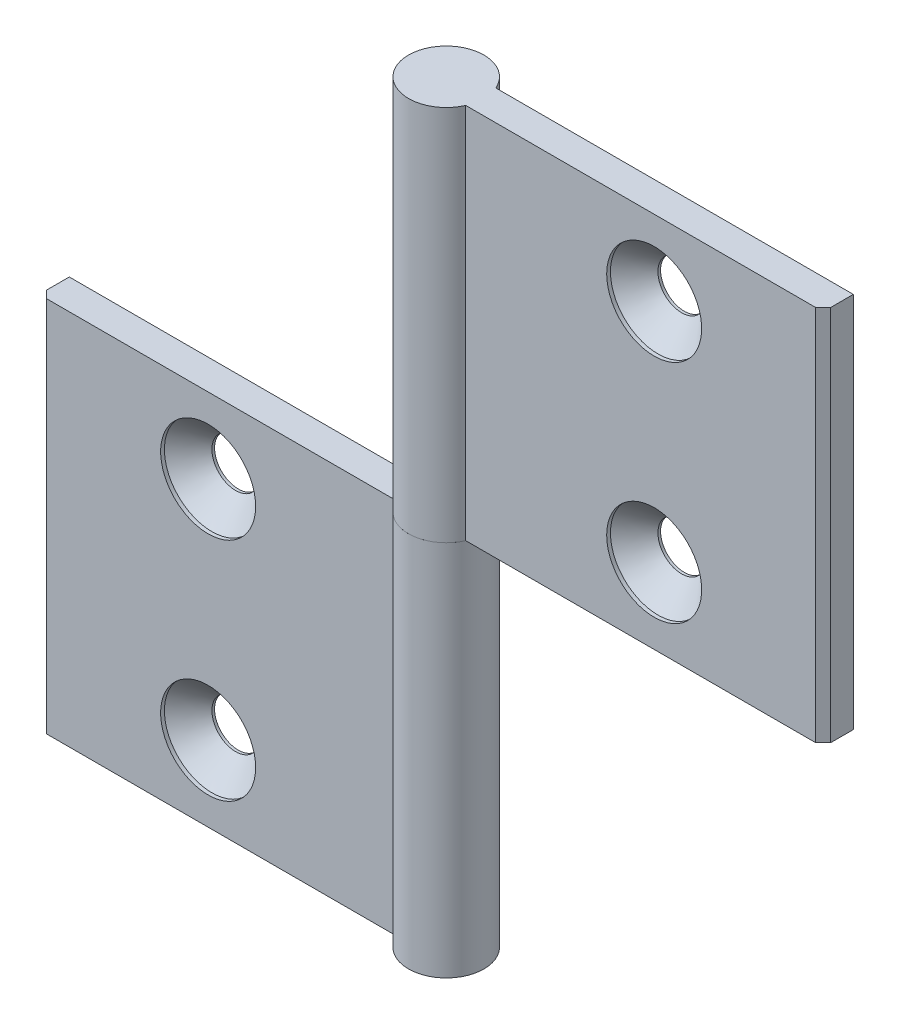
ISO-10303-21;
HEADER;
FILE_DESCRIPTION(('STEP AP214'),'2;1');
FILE_NAME('part.step','',(''),(''),'','','');
FILE_SCHEMA(('AUTOMOTIVE_DESIGN { 1 0 10303 214 1 1 1 1 }'));
ENDSEC;
DATA;
#1=APPLICATION_CONTEXT('core data for automotive mechanical design processes');
#2=APPLICATION_PROTOCOL_DEFINITION('international standard','automotive_design',2000,#1);
#3=PRODUCT_CONTEXT('',#1,'mechanical');
#4=PRODUCT('Part','Part','',(#3));
#5=PRODUCT_RELATED_PRODUCT_CATEGORY('part','',(#4));
#6=PRODUCT_DEFINITION_FORMATION('','',#4);
#7=PRODUCT_DEFINITION_CONTEXT('part definition',#1,'design');
#8=PRODUCT_DEFINITION('design','',#6,#7);
#9=PRODUCT_DEFINITION_SHAPE('','',#8);
#10=(LENGTH_UNIT() NAMED_UNIT(*) SI_UNIT(.MILLI.,.METRE.));
#11=(NAMED_UNIT(*) PLANE_ANGLE_UNIT() SI_UNIT($,.RADIAN.));
#12=(NAMED_UNIT(*) SI_UNIT($,.STERADIAN.) SOLID_ANGLE_UNIT());
#13=UNCERTAINTY_MEASURE_WITH_UNIT(LENGTH_MEASURE(1.E-05),#10,'distance_accuracy_value','');
#14=(GEOMETRIC_REPRESENTATION_CONTEXT(3) GLOBAL_UNCERTAINTY_ASSIGNED_CONTEXT((#13)) GLOBAL_UNIT_ASSIGNED_CONTEXT((#10,
#11,#12)) REPRESENTATION_CONTEXT('',''));
#15=CARTESIAN_POINT('',(0.,0.,0.));
#16=DIRECTION('',(0.,0.,1.));
#17=DIRECTION('',(1.,0.,0.));
#18=AXIS2_PLACEMENT_3D('',#15,#16,#17);
#19=CARTESIAN_POINT('',(0.,25.,0.));
#20=DIRECTION('',(0.,1.,0.));
#21=DIRECTION('',(0.,0.,-1.));
#22=AXIS2_PLACEMENT_3D('',#19,#20,#21);
#23=CYLINDRICAL_SURFACE('',#22,5.);
#24=CARTESIAN_POINT('',(0.,75.,0.));
#25=DIRECTION('',(0.,-1.,0.));
#26=DIRECTION('',(0.,0.,1.));
#27=AXIS2_PLACEMENT_3D('',#24,#25,#26);
#28=CIRCLE('',#27,5.);
#29=CARTESIAN_POINT('',(4.58257569495585,75.,1.99999999999997));
#30=VERTEX_POINT('',#29);
#31=CARTESIAN_POINT('',(4.58257569495582,75.,-2.00000000000004));
#32=VERTEX_POINT('',#31);
#33=EDGE_CURVE('E120',#30,#32,#28,.T.);
#34=ORIENTED_EDGE('',*,*,#33,.T.);
#35=DIRECTION('',(0.,1.,0.));
#36=VECTOR('',#35,1.);
#37=CARTESIAN_POINT('',(4.58257569495582,25.,-2.00000000000004));
#38=LINE('',#37,#36);
#39=CARTESIAN_POINT('',(4.58257569495582,25.,-2.00000000000004));
#40=VERTEX_POINT('',#39);
#41=EDGE_CURVE('E12',#40,#32,#38,.T.);
#42=ORIENTED_EDGE('',*,*,#41,.F.);
#43=CARTESIAN_POINT('',(0.,25.,0.));
#44=DIRECTION('',(0.,-1.,0.));
#45=DIRECTION('',(0.,0.,1.));
#46=AXIS2_PLACEMENT_3D('',#43,#44,#45);
#47=CIRCLE('',#46,5.);
#48=CARTESIAN_POINT('',(4.58257569495585,25.,1.99999999999997));
#49=VERTEX_POINT('',#48);
#50=EDGE_CURVE('E129',#49,#40,#47,.T.);
#51=ORIENTED_EDGE('',*,*,#50,.F.);
#52=DIRECTION('',(0.,1.,0.));
#53=VECTOR('',#52,1.);
#54=CARTESIAN_POINT('',(4.58257569495585,25.,1.99999999999997));
#55=LINE('',#54,#53);
#56=EDGE_CURVE('E116',#49,#30,#55,.T.);
#57=ORIENTED_EDGE('',*,*,#56,.T.);
#58=EDGE_LOOP('',(#34,#42,#51,#57));
#59=FACE_BOUND('',#58,.T.);
#60=ADVANCED_FACE('F44',(#59),#23,.T.);
#61=CARTESIAN_POINT('',(4.58257569495582,25.,-2.00000000000004));
#62=DIRECTION('',(0.,0.,1.));
#63=DIRECTION('',(-1.,0.,0.));
#64=AXIS2_PLACEMENT_3D('',#61,#62,#63);
#65=PLANE('',#64);
#66=CARTESIAN_POINT('',(29.5825756949558,35.,-2.00000000000022));
#67=DIRECTION('',(0.,0.,1.));
#68=DIRECTION('',(-1.,0.,0.));
#69=AXIS2_PLACEMENT_3D('',#66,#67,#68);
#70=CIRCLE('',#69,3.15);
#71=CARTESIAN_POINT('',(26.4325756949558,35.,-2.0000000000002));
#72=VERTEX_POINT('',#71);
#73=EDGE_CURVE('E47',#72,#72,#70,.T.);
#74=ORIENTED_EDGE('',*,*,#73,.T.);
#75=EDGE_LOOP('',(#74));
#76=FACE_BOUND('',#75,.T.);
#77=CARTESIAN_POINT('',(29.5825756949558,65.,-2.00000000000022));
#78=DIRECTION('',(0.,0.,1.));
#79=DIRECTION('',(-1.,0.,0.));
#80=AXIS2_PLACEMENT_3D('',#77,#78,#79);
#81=CIRCLE('',#80,3.15);
#82=CARTESIAN_POINT('',(26.4325756949558,65.,-2.0000000000002));
#83=VERTEX_POINT('',#82);
#84=EDGE_CURVE('E124',#83,#83,#81,.T.);
#85=ORIENTED_EDGE('',*,*,#84,.T.);
#86=EDGE_LOOP('',(#85));
#87=FACE_BOUND('',#86,.T.);
#88=DIRECTION('',(1.,0.,0.));
#89=VECTOR('',#88,1.);
#90=CARTESIAN_POINT('',(4.58257569495582,75.,-2.00000000000004));
#91=LINE('',#90,#89);
#92=CARTESIAN_POINT('',(52.,75.,-2.00000000000038));
#93=VERTEX_POINT('',#92);
#94=EDGE_CURVE('E123',#32,#93,#91,.T.);
#95=ORIENTED_EDGE('',*,*,#94,.T.);
#96=DIRECTION('',(0.,1.,0.));
#97=VECTOR('',#96,1.);
#98=CARTESIAN_POINT('',(52.,25.,-2.00000000000038));
#99=LINE('',#98,#97);
#100=CARTESIAN_POINT('',(52.,25.,-2.00000000000038));
#101=VERTEX_POINT('',#100);
#102=EDGE_CURVE('E53',#101,#93,#99,.T.);
#103=ORIENTED_EDGE('',*,*,#102,.F.);
#104=DIRECTION('',(1.,0.,0.));
#105=VECTOR('',#104,1.);
#106=CARTESIAN_POINT('',(4.58257569495582,25.,-2.00000000000004));
#107=LINE('',#106,#105);
#108=EDGE_CURVE('E96',#40,#101,#107,.T.);
#109=ORIENTED_EDGE('',*,*,#108,.F.);
#110=ORIENTED_EDGE('',*,*,#41,.T.);
#111=EDGE_LOOP('',(#95,#103,#109,#110));
#112=FACE_BOUND('',#111,.T.);
#113=ADVANCED_FACE('F150',(#76,#87,#112),#65,.F.);
#114=CARTESIAN_POINT('',(52.,25.,-2.00000000000038));
#115=DIRECTION('',(-1.,0.,0.));
#116=DIRECTION('',(0.,0.,-1.));
#117=AXIS2_PLACEMENT_3D('',#114,#115,#116);
#118=PLANE('',#117);
#119=DIRECTION('',(0.,0.,1.));
#120=VECTOR('',#119,1.);
#121=CARTESIAN_POINT('',(52.,75.,-2.00000000000038));
#122=LINE('',#121,#120);
#123=CARTESIAN_POINT('',(52.,75.,0.999999999999617));
#124=VERTEX_POINT('',#123);
#125=EDGE_CURVE('E111',#93,#124,#122,.T.);
#126=ORIENTED_EDGE('',*,*,#125,.T.);
#127=DIRECTION('',(0.,1.,0.));
#128=VECTOR('',#127,1.);
#129=CARTESIAN_POINT('',(52.,25.,0.999999999999617));
#130=LINE('',#129,#128);
#131=CARTESIAN_POINT('',(52.,25.,0.999999999999617));
#132=VERTEX_POINT('',#131);
#133=EDGE_CURVE('E108',#132,#124,#130,.T.);
#134=ORIENTED_EDGE('',*,*,#133,.F.);
#135=DIRECTION('',(0.,0.,1.));
#136=VECTOR('',#135,1.);
#137=CARTESIAN_POINT('',(52.,25.,-2.00000000000038));
#138=LINE('',#137,#136);
#139=EDGE_CURVE('E100',#101,#132,#138,.T.);
#140=ORIENTED_EDGE('',*,*,#139,.F.);
#141=ORIENTED_EDGE('',*,*,#102,.T.);
#142=EDGE_LOOP('',(#126,#134,#140,#141));
#143=FACE_BOUND('',#142,.T.);
#144=ADVANCED_FACE('F109',(#143),#118,.F.);
#145=CARTESIAN_POINT('',(52.,25.,0.999999999999617));
#146=DIRECTION('',(-0.707106781186548,0.,-0.707106781186547));
#147=DIRECTION('',(0.707106781186547,0.,-0.707106781186548));
#148=AXIS2_PLACEMENT_3D('',#145,#146,#147);
#149=PLANE('',#148);
#150=DIRECTION('',(-0.707106781186547,0.,0.707106781186548));
#151=VECTOR('',#150,1.);
#152=CARTESIAN_POINT('',(52.,75.,0.999999999999617));
#153=LINE('',#152,#151);
#154=CARTESIAN_POINT('',(51.,75.,1.99999999999961));
#155=VERTEX_POINT('',#154);
#156=EDGE_CURVE('E82',#124,#155,#153,.T.);
#157=ORIENTED_EDGE('',*,*,#156,.T.);
#158=DIRECTION('',(0.,1.,0.));
#159=VECTOR('',#158,1.);
#160=CARTESIAN_POINT('',(51.,25.,1.99999999999961));
#161=LINE('',#160,#159);
#162=CARTESIAN_POINT('',(51.,25.,1.99999999999961));
#163=VERTEX_POINT('',#162);
#164=EDGE_CURVE('E112',#163,#155,#161,.T.);
#165=ORIENTED_EDGE('',*,*,#164,.F.);
#166=DIRECTION('',(-0.707106781186547,0.,0.707106781186548));
#167=VECTOR('',#166,1.);
#168=CARTESIAN_POINT('',(52.,25.,0.999999999999617));
#169=LINE('',#168,#167);
#170=EDGE_CURVE('E104',#132,#163,#169,.T.);
#171=ORIENTED_EDGE('',*,*,#170,.F.);
#172=ORIENTED_EDGE('',*,*,#133,.T.);
#173=EDGE_LOOP('',(#157,#165,#171,#172));
#174=FACE_BOUND('',#173,.T.);
#175=ADVANCED_FACE('F114',(#174),#149,.F.);
#176=CARTESIAN_POINT('',(51.,25.,1.99999999999961));
#177=DIRECTION('',(0.,0.,-1.));
#178=DIRECTION('',(1.,0.,0.));
#179=AXIS2_PLACEMENT_3D('',#176,#177,#178);
#180=PLANE('',#179);
#181=CARTESIAN_POINT('',(29.5825756949559,35.,1.99999999999978));
#182=DIRECTION('',(0.,0.,1.));
#183=DIRECTION('',(-1.,0.,0.));
#184=AXIS2_PLACEMENT_3D('',#181,#182,#183);
#185=CIRCLE('',#184,6.3);
#186=CARTESIAN_POINT('',(23.2825756949559,35.,1.99999999999983));
#187=VERTEX_POINT('',#186);
#188=EDGE_CURVE('E184',#187,#187,#185,.T.);
#189=ORIENTED_EDGE('',*,*,#188,.F.);
#190=EDGE_LOOP('',(#189));
#191=FACE_BOUND('',#190,.T.);
#192=CARTESIAN_POINT('',(29.5825756949559,65.,1.99999999999978));
#193=DIRECTION('',(0.,0.,1.));
#194=DIRECTION('',(-1.,0.,0.));
#195=AXIS2_PLACEMENT_3D('',#192,#193,#194);
#196=CIRCLE('',#195,6.3);
#197=CARTESIAN_POINT('',(23.2825756949559,65.,1.99999999999983));
#198=VERTEX_POINT('',#197);
#199=EDGE_CURVE('E142',#198,#198,#196,.T.);
#200=ORIENTED_EDGE('',*,*,#199,.F.);
#201=EDGE_LOOP('',(#200));
#202=FACE_BOUND('',#201,.T.);
#203=DIRECTION('',(-1.,0.,0.));
#204=VECTOR('',#203,1.);
#205=CARTESIAN_POINT('',(51.,75.,1.99999999999961));
#206=LINE('',#205,#204);
#207=EDGE_CURVE('E88',#155,#30,#206,.T.);
#208=ORIENTED_EDGE('',*,*,#207,.T.);
#209=ORIENTED_EDGE('',*,*,#56,.F.);
#210=DIRECTION('',(-1.,0.,0.));
#211=VECTOR('',#210,1.);
#212=CARTESIAN_POINT('',(51.,25.,1.99999999999961));
#213=LINE('',#212,#211);
#214=EDGE_CURVE('E62',#163,#49,#213,.T.);
#215=ORIENTED_EDGE('',*,*,#214,.F.);
#216=ORIENTED_EDGE('',*,*,#164,.T.);
#217=EDGE_LOOP('',(#208,#209,#215,#216));
#218=FACE_BOUND('',#217,.T.);
#219=ADVANCED_FACE('F162',(#191,#202,#218),#180,.F.);
#220=CARTESIAN_POINT('',(0.,25.,0.));
#221=DIRECTION('',(0.,-1.,0.));
#222=DIRECTION('',(0.,0.,1.));
#223=AXIS2_PLACEMENT_3D('',#220,#221,#222);
#224=PLANE('',#223);
#225=ORIENTED_EDGE('',*,*,#50,.T.);
#226=ORIENTED_EDGE('',*,*,#108,.T.);
#227=ORIENTED_EDGE('',*,*,#139,.T.);
#228=ORIENTED_EDGE('',*,*,#170,.T.);
#229=ORIENTED_EDGE('',*,*,#214,.T.);
#230=EDGE_LOOP('',(#225,#226,#227,#228,#229));
#231=FACE_BOUND('',#230,.T.);
#232=ADVANCED_FACE('F102',(#231),#224,.T.);
#233=CARTESIAN_POINT('',(0.,75.,0.));
#234=DIRECTION('',(0.,-1.,0.));
#235=DIRECTION('',(0.,0.,1.));
#236=AXIS2_PLACEMENT_3D('',#233,#234,#235);
#237=PLANE('',#236);
#238=ORIENTED_EDGE('',*,*,#33,.F.);
#239=ORIENTED_EDGE('',*,*,#207,.F.);
#240=ORIENTED_EDGE('',*,*,#156,.F.);
#241=ORIENTED_EDGE('',*,*,#125,.F.);
#242=ORIENTED_EDGE('',*,*,#94,.F.);
#243=EDGE_LOOP('',(#238,#239,#240,#241,#242));
#244=FACE_BOUND('',#243,.T.);
#245=ADVANCED_FACE('F152',(#244),#237,.F.);
#246=CARTESIAN_POINT('',(29.5825756949559,65.,1.99999999999978));
#247=DIRECTION('',(0.,0.,1.));
#248=DIRECTION('',(-1.,0.,0.));
#249=AXIS2_PLACEMENT_3D('',#246,#247,#248);
#250=CYLINDRICAL_SURFACE('',#249,3.15);
#251=CARTESIAN_POINT('',(29.5825756949558,65.,-1.65000000000022));
#252=DIRECTION('',(0.,0.,1.));
#253=DIRECTION('',(-1.,0.,0.));
#254=AXIS2_PLACEMENT_3D('',#251,#252,#253);
#255=CIRCLE('',#254,3.15);
#256=CARTESIAN_POINT('',(26.4325756949558,65.,-1.65000000000019));
#257=VERTEX_POINT('',#256);
#258=EDGE_CURVE('E133',#257,#257,#255,.T.);
#259=ORIENTED_EDGE('',*,*,#258,.T.);
#260=EDGE_LOOP('',(#259));
#261=FACE_BOUND('',#260,.T.);
#262=ORIENTED_EDGE('',*,*,#84,.F.);
#263=EDGE_LOOP('',(#262));
#264=FACE_BOUND('',#263,.T.);
#265=ADVANCED_FACE('F154',(#261,#264),#250,.F.);
#266=CARTESIAN_POINT('',(29.5825756949558,65.,1.49999999999978));
#267=DIRECTION('',(0.,0.,1.));
#268=DIRECTION('',(-1.,0.,0.));
#269=AXIS2_PLACEMENT_3D('',#266,#267,#268);
#270=CONICAL_SURFACE('',#269,6.3,0.785398163397449);
#271=ORIENTED_EDGE('',*,*,#258,.F.);
#272=EDGE_LOOP('',(#271));
#273=FACE_BOUND('',#272,.T.);
#274=CARTESIAN_POINT('',(29.5825756949558,65.,1.49999999999978));
#275=DIRECTION('',(0.,0.,1.));
#276=DIRECTION('',(-1.,0.,0.));
#277=AXIS2_PLACEMENT_3D('',#274,#275,#276);
#278=CIRCLE('',#277,6.3);
#279=CARTESIAN_POINT('',(23.2825756949558,65.,1.49999999999983));
#280=VERTEX_POINT('',#279);
#281=EDGE_CURVE('E137',#280,#280,#278,.T.);
#282=ORIENTED_EDGE('',*,*,#281,.T.);
#283=EDGE_LOOP('',(#282));
#284=FACE_BOUND('',#283,.T.);
#285=ADVANCED_FACE('F160',(#273,#284),#270,.F.);
#286=CARTESIAN_POINT('',(29.5825756949559,65.,1.99999999999978));
#287=DIRECTION('',(0.,0.,1.));
#288=DIRECTION('',(-1.,0.,0.));
#289=AXIS2_PLACEMENT_3D('',#286,#287,#288);
#290=CYLINDRICAL_SURFACE('',#289,6.3);
#291=ORIENTED_EDGE('',*,*,#281,.F.);
#292=EDGE_LOOP('',(#291));
#293=FACE_BOUND('',#292,.T.);
#294=ORIENTED_EDGE('',*,*,#199,.T.);
#295=EDGE_LOOP('',(#294));
#296=FACE_BOUND('',#295,.T.);
#297=ADVANCED_FACE('F211',(#293,#296),#290,.F.);
#298=CARTESIAN_POINT('',(29.5825756949559,35.,1.99999999999978));
#299=DIRECTION('',(0.,0.,1.));
#300=DIRECTION('',(-1.,0.,0.));
#301=AXIS2_PLACEMENT_3D('',#298,#299,#300);
#302=CYLINDRICAL_SURFACE('',#301,3.15);
#303=CARTESIAN_POINT('',(29.5825756949558,35.,-1.65000000000022));
#304=DIRECTION('',(0.,0.,1.));
#305=DIRECTION('',(-1.,0.,0.));
#306=AXIS2_PLACEMENT_3D('',#303,#304,#305);
#307=CIRCLE('',#306,3.15);
#308=CARTESIAN_POINT('',(26.4325756949558,35.,-1.65000000000019));
#309=VERTEX_POINT('',#308);
#310=EDGE_CURVE('E188',#309,#309,#307,.T.);
#311=ORIENTED_EDGE('',*,*,#310,.T.);
#312=EDGE_LOOP('',(#311));
#313=FACE_BOUND('',#312,.T.);
#314=ORIENTED_EDGE('',*,*,#73,.F.);
#315=EDGE_LOOP('',(#314));
#316=FACE_BOUND('',#315,.T.);
#317=ADVANCED_FACE('F204',(#313,#316),#302,.F.);
#318=CARTESIAN_POINT('',(29.5825756949558,35.,1.49999999999978));
#319=DIRECTION('',(0.,0.,1.));
#320=DIRECTION('',(-1.,0.,0.));
#321=AXIS2_PLACEMENT_3D('',#318,#319,#320);
#322=CONICAL_SURFACE('',#321,6.3,0.785398163397449);
#323=ORIENTED_EDGE('',*,*,#310,.F.);
#324=EDGE_LOOP('',(#323));
#325=FACE_BOUND('',#324,.T.);
#326=CARTESIAN_POINT('',(29.5825756949558,35.,1.49999999999978));
#327=DIRECTION('',(0.,0.,1.));
#328=DIRECTION('',(-1.,0.,0.));
#329=AXIS2_PLACEMENT_3D('',#326,#327,#328);
#330=CIRCLE('',#329,6.3);
#331=CARTESIAN_POINT('',(23.2825756949558,35.,1.49999999999983));
#332=VERTEX_POINT('',#331);
#333=EDGE_CURVE('E192',#332,#332,#330,.T.);
#334=ORIENTED_EDGE('',*,*,#333,.T.);
#335=EDGE_LOOP('',(#334));
#336=FACE_BOUND('',#335,.T.);
#337=ADVANCED_FACE('F198',(#325,#336),#322,.F.);
#338=CARTESIAN_POINT('',(29.5825756949559,35.,1.99999999999978));
#339=DIRECTION('',(0.,0.,1.));
#340=DIRECTION('',(-1.,0.,0.));
#341=AXIS2_PLACEMENT_3D('',#338,#339,#340);
#342=CYLINDRICAL_SURFACE('',#341,6.3);
#343=ORIENTED_EDGE('',*,*,#333,.F.);
#344=EDGE_LOOP('',(#343));
#345=FACE_BOUND('',#344,.T.);
#346=ORIENTED_EDGE('',*,*,#188,.T.);
#347=EDGE_LOOP('',(#346));
#348=FACE_BOUND('',#347,.T.);
#349=ADVANCED_FACE('F196',(#345,#348),#342,.F.);
#350=CLOSED_SHELL('',(#60,#113,#144,#175,#219,#232,#245,#265,#285,#297,#317,#337,#349));
#351=MANIFOLD_SOLID_BREP('B2',#350);
#352=CARTESIAN_POINT('',(0.,25.,0.));
#353=DIRECTION('',(0.,-1.,0.));
#354=DIRECTION('',(0.,0.,-1.));
#355=AXIS2_PLACEMENT_3D('',#352,#353,#354);
#356=CYLINDRICAL_SURFACE('',#355,5.);
#357=CARTESIAN_POINT('',(0.,-25.,0.));
#358=DIRECTION('',(0.,1.,0.));
#359=DIRECTION('',(0.,0.,1.));
#360=AXIS2_PLACEMENT_3D('',#357,#358,#359);
#361=CIRCLE('',#360,5.);
#362=CARTESIAN_POINT('',(-4.58257569495584,-25.,2.));
#363=VERTEX_POINT('',#362);
#364=CARTESIAN_POINT('',(-4.58257569495584,-25.,-2.));
#365=VERTEX_POINT('',#364);
#366=EDGE_CURVE('E371',#363,#365,#361,.T.);
#367=ORIENTED_EDGE('',*,*,#366,.T.);
#368=DIRECTION('',(0.,-1.,0.));
#369=VECTOR('',#368,1.);
#370=CARTESIAN_POINT('',(-4.58257569495584,25.,-2.));
#371=LINE('',#370,#369);
#372=CARTESIAN_POINT('',(-4.58257569495584,25.,-2.));
#373=VERTEX_POINT('',#372);
#374=EDGE_CURVE('E42',#373,#365,#371,.T.);
#375=ORIENTED_EDGE('',*,*,#374,.F.);
#376=CARTESIAN_POINT('',(0.,25.,0.));
#377=DIRECTION('',(0.,1.,0.));
#378=DIRECTION('',(0.,0.,1.));
#379=AXIS2_PLACEMENT_3D('',#376,#377,#378);
#380=CIRCLE('',#379,5.);
#381=CARTESIAN_POINT('',(-4.58257569495584,25.,2.));
#382=VERTEX_POINT('',#381);
#383=EDGE_CURVE('E380',#382,#373,#380,.T.);
#384=ORIENTED_EDGE('',*,*,#383,.F.);
#385=DIRECTION('',(0.,-1.,0.));
#386=VECTOR('',#385,1.);
#387=CARTESIAN_POINT('',(-4.58257569495584,25.,2.));
#388=LINE('',#387,#386);
#389=EDGE_CURVE('E367',#382,#363,#388,.T.);
#390=ORIENTED_EDGE('',*,*,#389,.T.);
#391=EDGE_LOOP('',(#367,#375,#384,#390));
#392=FACE_BOUND('',#391,.T.);
#393=ADVANCED_FACE('F295',(#392),#356,.T.);
#394=CARTESIAN_POINT('',(-4.58257569495584,25.,-2.));
#395=DIRECTION('',(0.,0.,1.));
#396=DIRECTION('',(1.,0.,0.));
#397=AXIS2_PLACEMENT_3D('',#394,#395,#396);
#398=PLANE('',#397);
#399=CARTESIAN_POINT('',(-29.5825756949558,15.,-2.));
#400=DIRECTION('',(0.,0.,1.));
#401=DIRECTION('',(1.,0.,0.));
#402=AXIS2_PLACEMENT_3D('',#399,#400,#401);
#403=CIRCLE('',#402,3.15);
#404=CARTESIAN_POINT('',(-26.4325756949558,15.,-2.));
#405=VERTEX_POINT('',#404);
#406=EDGE_CURVE('E298',#405,#405,#403,.T.);
#407=ORIENTED_EDGE('',*,*,#406,.T.);
#408=EDGE_LOOP('',(#407));
#409=FACE_BOUND('',#408,.T.);
#410=CARTESIAN_POINT('',(-29.5825756949558,-15.,-2.));
#411=DIRECTION('',(0.,0.,1.));
#412=DIRECTION('',(1.,0.,0.));
#413=AXIS2_PLACEMENT_3D('',#410,#411,#412);
#414=CIRCLE('',#413,3.15);
#415=CARTESIAN_POINT('',(-26.4325756949558,-15.,-2.));
#416=VERTEX_POINT('',#415);
#417=EDGE_CURVE('E375',#416,#416,#414,.T.);
#418=ORIENTED_EDGE('',*,*,#417,.T.);
#419=EDGE_LOOP('',(#418));
#420=FACE_BOUND('',#419,.T.);
#421=DIRECTION('',(-1.,0.,0.));
#422=VECTOR('',#421,1.);
#423=CARTESIAN_POINT('',(-4.58257569495584,-25.,-2.));
#424=LINE('',#423,#422);
#425=CARTESIAN_POINT('',(-52.,-25.,-1.99999999999999));
#426=VERTEX_POINT('',#425);
#427=EDGE_CURVE('E374',#365,#426,#424,.T.);
#428=ORIENTED_EDGE('',*,*,#427,.T.);
#429=DIRECTION('',(0.,-1.,0.));
#430=VECTOR('',#429,1.);
#431=CARTESIAN_POINT('',(-52.,25.,-1.99999999999999));
#432=LINE('',#431,#430);
#433=CARTESIAN_POINT('',(-52.,25.,-1.99999999999999));
#434=VERTEX_POINT('',#433);
#435=EDGE_CURVE('E304',#434,#426,#432,.T.);
#436=ORIENTED_EDGE('',*,*,#435,.F.);
#437=DIRECTION('',(-1.,0.,0.));
#438=VECTOR('',#437,1.);
#439=CARTESIAN_POINT('',(-4.58257569495584,25.,-2.));
#440=LINE('',#439,#438);
#441=EDGE_CURVE('E347',#373,#434,#440,.T.);
#442=ORIENTED_EDGE('',*,*,#441,.F.);
#443=ORIENTED_EDGE('',*,*,#374,.T.);
#444=EDGE_LOOP('',(#428,#436,#442,#443));
#445=FACE_BOUND('',#444,.T.);
#446=ADVANCED_FACE('F401',(#409,#420,#445),#398,.F.);
#447=CARTESIAN_POINT('',(-52.,25.,-1.99999999999999));
#448=DIRECTION('',(1.,0.,0.));
#449=DIRECTION('',(0.,0.,-1.));
#450=AXIS2_PLACEMENT_3D('',#447,#448,#449);
#451=PLANE('',#450);
#452=DIRECTION('',(0.,0.,1.));
#453=VECTOR('',#452,1.);
#454=CARTESIAN_POINT('',(-52.,-25.,-1.99999999999999));
#455=LINE('',#454,#453);
#456=CARTESIAN_POINT('',(-52.,-25.,1.00000000000001));
#457=VERTEX_POINT('',#456);
#458=EDGE_CURVE('E362',#426,#457,#455,.T.);
#459=ORIENTED_EDGE('',*,*,#458,.T.);
#460=DIRECTION('',(0.,-1.,0.));
#461=VECTOR('',#460,1.);
#462=CARTESIAN_POINT('',(-52.,25.,1.00000000000001));
#463=LINE('',#462,#461);
#464=CARTESIAN_POINT('',(-52.,25.,1.00000000000001));
#465=VERTEX_POINT('',#464);
#466=EDGE_CURVE('E359',#465,#457,#463,.T.);
#467=ORIENTED_EDGE('',*,*,#466,.F.);
#468=DIRECTION('',(0.,0.,1.));
#469=VECTOR('',#468,1.);
#470=CARTESIAN_POINT('',(-52.,25.,-1.99999999999999));
#471=LINE('',#470,#469);
#472=EDGE_CURVE('E351',#434,#465,#471,.T.);
#473=ORIENTED_EDGE('',*,*,#472,.F.);
#474=ORIENTED_EDGE('',*,*,#435,.T.);
#475=EDGE_LOOP('',(#459,#467,#473,#474));
#476=FACE_BOUND('',#475,.T.);
#477=ADVANCED_FACE('F360',(#476),#451,.F.);
#478=CARTESIAN_POINT('',(-52.,25.,1.00000000000001));
#479=DIRECTION('',(0.707106781186543,0.,-0.707106781186552));
#480=DIRECTION('',(-0.707106781186552,0.,-0.707106781186543));
#481=AXIS2_PLACEMENT_3D('',#478,#479,#480);
#482=PLANE('',#481);
#483=DIRECTION('',(0.707106781186552,0.,0.707106781186543));
#484=VECTOR('',#483,1.);
#485=CARTESIAN_POINT('',(-52.,-25.,1.00000000000001));
#486=LINE('',#485,#484);
#487=CARTESIAN_POINT('',(-51.,-25.,1.99999999999999));
#488=VERTEX_POINT('',#487);
#489=EDGE_CURVE('E333',#457,#488,#486,.T.);
#490=ORIENTED_EDGE('',*,*,#489,.T.);
#491=DIRECTION('',(0.,-1.,0.));
#492=VECTOR('',#491,1.);
#493=CARTESIAN_POINT('',(-51.,25.,1.99999999999999));
#494=LINE('',#493,#492);
#495=CARTESIAN_POINT('',(-51.,25.,1.99999999999999));
#496=VERTEX_POINT('',#495);
#497=EDGE_CURVE('E363',#496,#488,#494,.T.);
#498=ORIENTED_EDGE('',*,*,#497,.F.);
#499=DIRECTION('',(0.707106781186552,0.,0.707106781186543));
#500=VECTOR('',#499,1.);
#501=CARTESIAN_POINT('',(-52.,25.,1.00000000000001));
#502=LINE('',#501,#500);
#503=EDGE_CURVE('E355',#465,#496,#502,.T.);
#504=ORIENTED_EDGE('',*,*,#503,.F.);
#505=ORIENTED_EDGE('',*,*,#466,.T.);
#506=EDGE_LOOP('',(#490,#498,#504,#505));
#507=FACE_BOUND('',#506,.T.);
#508=ADVANCED_FACE('F365',(#507),#482,.F.);
#509=CARTESIAN_POINT('',(-51.,25.,1.99999999999999));
#510=DIRECTION('',(0.,0.,-1.));
#511=DIRECTION('',(-1.,0.,0.));
#512=AXIS2_PLACEMENT_3D('',#509,#510,#511);
#513=PLANE('',#512);
#514=CARTESIAN_POINT('',(-29.5825756949558,15.,2.));
#515=DIRECTION('',(0.,0.,1.));
#516=DIRECTION('',(1.,0.,0.));
#517=AXIS2_PLACEMENT_3D('',#514,#515,#516);
#518=CIRCLE('',#517,6.3);
#519=CARTESIAN_POINT('',(-23.2825756949558,15.,2.));
#520=VERTEX_POINT('',#519);
#521=EDGE_CURVE('E435',#520,#520,#518,.T.);
#522=ORIENTED_EDGE('',*,*,#521,.F.);
#523=EDGE_LOOP('',(#522));
#524=FACE_BOUND('',#523,.T.);
#525=CARTESIAN_POINT('',(-29.5825756949558,-15.,2.));
#526=DIRECTION('',(0.,0.,1.));
#527=DIRECTION('',(1.,0.,0.));
#528=AXIS2_PLACEMENT_3D('',#525,#526,#527);
#529=CIRCLE('',#528,6.3);
#530=CARTESIAN_POINT('',(-23.2825756949558,-15.,2.));
#531=VERTEX_POINT('',#530);
#532=EDGE_CURVE('E393',#531,#531,#529,.T.);
#533=ORIENTED_EDGE('',*,*,#532,.F.);
#534=EDGE_LOOP('',(#533));
#535=FACE_BOUND('',#534,.T.);
#536=DIRECTION('',(1.,0.,0.));
#537=VECTOR('',#536,1.);
#538=CARTESIAN_POINT('',(-51.,-25.,1.99999999999999));
#539=LINE('',#538,#537);
#540=EDGE_CURVE('E339',#488,#363,#539,.T.);
#541=ORIENTED_EDGE('',*,*,#540,.T.);
#542=ORIENTED_EDGE('',*,*,#389,.F.);
#543=DIRECTION('',(1.,0.,0.));
#544=VECTOR('',#543,1.);
#545=CARTESIAN_POINT('',(-51.,25.,1.99999999999999));
#546=LINE('',#545,#544);
#547=EDGE_CURVE('E313',#496,#382,#546,.T.);
#548=ORIENTED_EDGE('',*,*,#547,.F.);
#549=ORIENTED_EDGE('',*,*,#497,.T.);
#550=EDGE_LOOP('',(#541,#542,#548,#549));
#551=FACE_BOUND('',#550,.T.);
#552=ADVANCED_FACE('F413',(#524,#535,#551),#513,.F.);
#553=CARTESIAN_POINT('',(0.,25.,0.));
#554=DIRECTION('',(0.,1.,0.));
#555=DIRECTION('',(0.,0.,1.));
#556=AXIS2_PLACEMENT_3D('',#553,#554,#555);
#557=PLANE('',#556);
#558=ORIENTED_EDGE('',*,*,#383,.T.);
#559=ORIENTED_EDGE('',*,*,#441,.T.);
#560=ORIENTED_EDGE('',*,*,#472,.T.);
#561=ORIENTED_EDGE('',*,*,#503,.T.);
#562=ORIENTED_EDGE('',*,*,#547,.T.);
#563=EDGE_LOOP('',(#558,#559,#560,#561,#562));
#564=FACE_BOUND('',#563,.T.);
#565=ADVANCED_FACE('F353',(#564),#557,.T.);
#566=CARTESIAN_POINT('',(0.,-25.,0.));
#567=DIRECTION('',(0.,1.,0.));
#568=DIRECTION('',(0.,0.,1.));
#569=AXIS2_PLACEMENT_3D('',#566,#567,#568);
#570=PLANE('',#569);
#571=ORIENTED_EDGE('',*,*,#366,.F.);
#572=ORIENTED_EDGE('',*,*,#540,.F.);
#573=ORIENTED_EDGE('',*,*,#489,.F.);
#574=ORIENTED_EDGE('',*,*,#458,.F.);
#575=ORIENTED_EDGE('',*,*,#427,.F.);
#576=EDGE_LOOP('',(#571,#572,#573,#574,#575));
#577=FACE_BOUND('',#576,.T.);
#578=ADVANCED_FACE('F403',(#577),#570,.F.);
#579=CARTESIAN_POINT('',(-29.5825756949558,-15.,2.));
#580=DIRECTION('',(0.,0.,1.));
#581=DIRECTION('',(1.,0.,0.));
#582=AXIS2_PLACEMENT_3D('',#579,#580,#581);
#583=CYLINDRICAL_SURFACE('',#582,3.15);
#584=CARTESIAN_POINT('',(-29.5825756949558,-15.,-1.65));
#585=DIRECTION('',(0.,0.,1.));
#586=DIRECTION('',(1.,0.,0.));
#587=AXIS2_PLACEMENT_3D('',#584,#585,#586);
#588=CIRCLE('',#587,3.15);
#589=CARTESIAN_POINT('',(-26.4325756949558,-15.,-1.65));
#590=VERTEX_POINT('',#589);
#591=EDGE_CURVE('E384',#590,#590,#588,.T.);
#592=ORIENTED_EDGE('',*,*,#591,.T.);
#593=EDGE_LOOP('',(#592));
#594=FACE_BOUND('',#593,.T.);
#595=ORIENTED_EDGE('',*,*,#417,.F.);
#596=EDGE_LOOP('',(#595));
#597=FACE_BOUND('',#596,.T.);
#598=ADVANCED_FACE('F405',(#594,#597),#583,.F.);
#599=CARTESIAN_POINT('',(-29.5825756949558,-15.,1.5));
#600=DIRECTION('',(0.,0.,1.));
#601=DIRECTION('',(1.,0.,0.));
#602=AXIS2_PLACEMENT_3D('',#599,#600,#601);
#603=CONICAL_SURFACE('',#602,6.3,0.785398163397449);
#604=ORIENTED_EDGE('',*,*,#591,.F.);
#605=EDGE_LOOP('',(#604));
#606=FACE_BOUND('',#605,.T.);
#607=CARTESIAN_POINT('',(-29.5825756949558,-15.,1.5));
#608=DIRECTION('',(0.,0.,1.));
#609=DIRECTION('',(1.,0.,0.));
#610=AXIS2_PLACEMENT_3D('',#607,#608,#609);
#611=CIRCLE('',#610,6.3);
#612=CARTESIAN_POINT('',(-23.2825756949558,-15.,1.5));
#613=VERTEX_POINT('',#612);
#614=EDGE_CURVE('E388',#613,#613,#611,.T.);
#615=ORIENTED_EDGE('',*,*,#614,.T.);
#616=EDGE_LOOP('',(#615));
#617=FACE_BOUND('',#616,.T.);
#618=ADVANCED_FACE('F411',(#606,#617),#603,.F.);
#619=CARTESIAN_POINT('',(-29.5825756949558,-15.,2.));
#620=DIRECTION('',(0.,0.,1.));
#621=DIRECTION('',(1.,0.,0.));
#622=AXIS2_PLACEMENT_3D('',#619,#620,#621);
#623=CYLINDRICAL_SURFACE('',#622,6.3);
#624=ORIENTED_EDGE('',*,*,#614,.F.);
#625=EDGE_LOOP('',(#624));
#626=FACE_BOUND('',#625,.T.);
#627=ORIENTED_EDGE('',*,*,#532,.T.);
#628=EDGE_LOOP('',(#627));
#629=FACE_BOUND('',#628,.T.);
#630=ADVANCED_FACE('F462',(#626,#629),#623,.F.);
#631=CARTESIAN_POINT('',(-29.5825756949558,15.,2.));
#632=DIRECTION('',(0.,0.,1.));
#633=DIRECTION('',(1.,0.,0.));
#634=AXIS2_PLACEMENT_3D('',#631,#632,#633);
#635=CYLINDRICAL_SURFACE('',#634,3.15);
#636=CARTESIAN_POINT('',(-29.5825756949558,15.,-1.65));
#637=DIRECTION('',(0.,0.,1.));
#638=DIRECTION('',(1.,0.,0.));
#639=AXIS2_PLACEMENT_3D('',#636,#637,#638);
#640=CIRCLE('',#639,3.15);
#641=CARTESIAN_POINT('',(-26.4325756949558,15.,-1.65));
#642=VERTEX_POINT('',#641);
#643=EDGE_CURVE('E439',#642,#642,#640,.T.);
#644=ORIENTED_EDGE('',*,*,#643,.T.);
#645=EDGE_LOOP('',(#644));
#646=FACE_BOUND('',#645,.T.);
#647=ORIENTED_EDGE('',*,*,#406,.F.);
#648=EDGE_LOOP('',(#647));
#649=FACE_BOUND('',#648,.T.);
#650=ADVANCED_FACE('F455',(#646,#649),#635,.F.);
#651=CARTESIAN_POINT('',(-29.5825756949558,15.,1.5));
#652=DIRECTION('',(0.,0.,1.));
#653=DIRECTION('',(1.,0.,0.));
#654=AXIS2_PLACEMENT_3D('',#651,#652,#653);
#655=CONICAL_SURFACE('',#654,6.3,0.785398163397449);
#656=ORIENTED_EDGE('',*,*,#643,.F.);
#657=EDGE_LOOP('',(#656));
#658=FACE_BOUND('',#657,.T.);
#659=CARTESIAN_POINT('',(-29.5825756949558,15.,1.5));
#660=DIRECTION('',(0.,0.,1.));
#661=DIRECTION('',(1.,0.,0.));
#662=AXIS2_PLACEMENT_3D('',#659,#660,#661);
#663=CIRCLE('',#662,6.3);
#664=CARTESIAN_POINT('',(-23.2825756949558,15.,1.5));
#665=VERTEX_POINT('',#664);
#666=EDGE_CURVE('E443',#665,#665,#663,.T.);
#667=ORIENTED_EDGE('',*,*,#666,.T.);
#668=EDGE_LOOP('',(#667));
#669=FACE_BOUND('',#668,.T.);
#670=ADVANCED_FACE('F449',(#658,#669),#655,.F.);
#671=CARTESIAN_POINT('',(-29.5825756949558,15.,2.));
#672=DIRECTION('',(0.,0.,1.));
#673=DIRECTION('',(1.,0.,0.));
#674=AXIS2_PLACEMENT_3D('',#671,#672,#673);
#675=CYLINDRICAL_SURFACE('',#674,6.3);
#676=ORIENTED_EDGE('',*,*,#666,.F.);
#677=EDGE_LOOP('',(#676));
#678=FACE_BOUND('',#677,.T.);
#679=ORIENTED_EDGE('',*,*,#521,.T.);
#680=EDGE_LOOP('',(#679));
#681=FACE_BOUND('',#680,.T.);
#682=ADVANCED_FACE('F447',(#678,#681),#675,.F.);
#683=CLOSED_SHELL('',(#393,#446,#477,#508,#552,#565,#578,#598,#618,#630,#650,#670,#682));
#684=MANIFOLD_SOLID_BREP('B6',#683);
#685=ADVANCED_BREP_SHAPE_REPRESENTATION('',(#18,#351,#684),#14);
#686=SHAPE_DEFINITION_REPRESENTATION(#9,#685);
ENDSEC;
END-ISO-10303-21;
